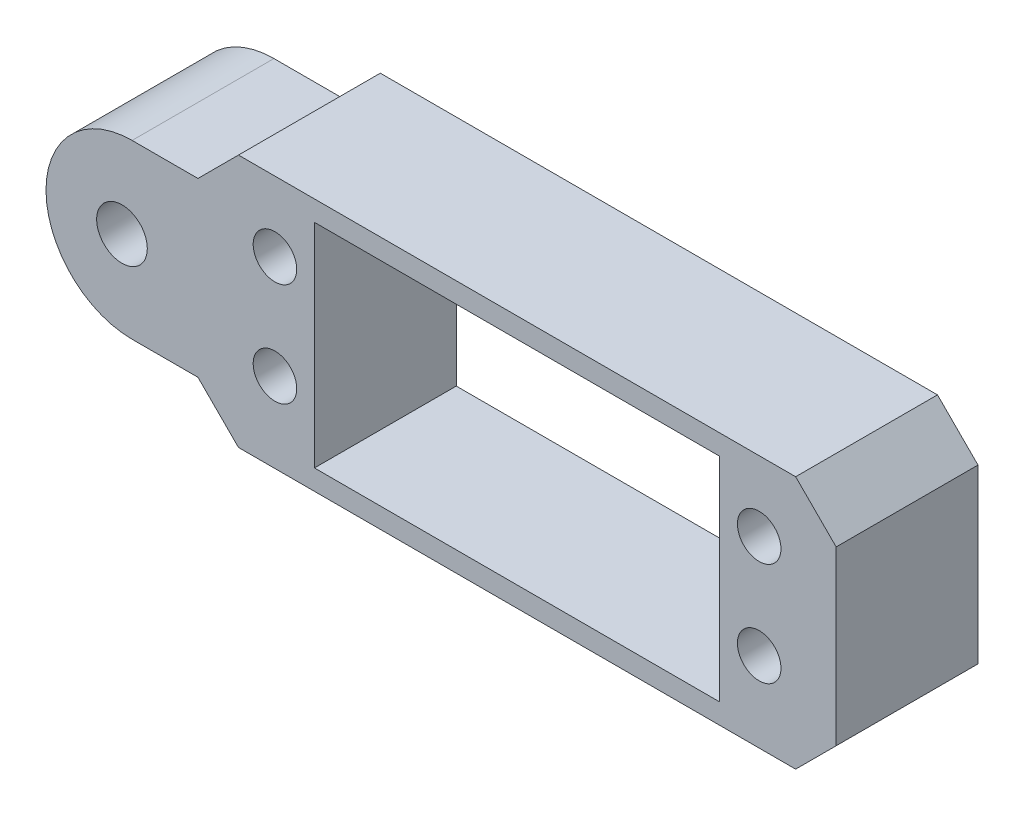
ISO-10303-21;
HEADER;
FILE_DESCRIPTION(('STEP AP214'),'2;1');
FILE_NAME('part.step','',(''),(''),'','','');
FILE_SCHEMA(('AUTOMOTIVE_DESIGN { 1 0 10303 214 1 1 1 1 }'));
ENDSEC;
DATA;
#1=APPLICATION_CONTEXT('core data for automotive mechanical design processes');
#2=APPLICATION_PROTOCOL_DEFINITION('international standard','automotive_design',2000,#1);
#3=PRODUCT_CONTEXT('',#1,'mechanical');
#4=PRODUCT('Part','Part','',(#3));
#5=PRODUCT_RELATED_PRODUCT_CATEGORY('part','',(#4));
#6=PRODUCT_DEFINITION_FORMATION('','',#4);
#7=PRODUCT_DEFINITION_CONTEXT('part definition',#1,'design');
#8=PRODUCT_DEFINITION('design','',#6,#7);
#9=PRODUCT_DEFINITION_SHAPE('','',#8);
#10=(LENGTH_UNIT() NAMED_UNIT(*) SI_UNIT(.MILLI.,.METRE.));
#11=(NAMED_UNIT(*) PLANE_ANGLE_UNIT() SI_UNIT($,.RADIAN.));
#12=(NAMED_UNIT(*) SI_UNIT($,.STERADIAN.) SOLID_ANGLE_UNIT());
#13=UNCERTAINTY_MEASURE_WITH_UNIT(LENGTH_MEASURE(1.E-05),#10,'distance_accuracy_value','');
#14=(GEOMETRIC_REPRESENTATION_CONTEXT(3) GLOBAL_UNCERTAINTY_ASSIGNED_CONTEXT((#13)) GLOBAL_UNIT_ASSIGNED_CONTEXT((#10,
#11,#12)) REPRESENTATION_CONTEXT('',''));
#15=CARTESIAN_POINT('',(0.,0.,0.));
#16=DIRECTION('',(0.,0.,1.));
#17=DIRECTION('',(1.,0.,0.));
#18=AXIS2_PLACEMENT_3D('',#15,#16,#17);
#19=CARTESIAN_POINT('',(-38.,0.,0.));
#20=DIRECTION('',(0.,0.,1.));
#21=DIRECTION('',(1.,0.,0.));
#22=AXIS2_PLACEMENT_3D('',#19,#20,#21);
#23=CYLINDRICAL_SURFACE('',#22,8.49999999999999);
#24=DIRECTION('',(0.,0.,1.));
#25=VECTOR('',#24,1.);
#26=CARTESIAN_POINT('',(-38.,8.5,-22.6715680975093));
#27=LINE('',#26,#25);
#28=CARTESIAN_POINT('',(-38.,8.5,0.));
#29=VERTEX_POINT('',#28);
#30=CARTESIAN_POINT('',(-38.,8.5,14.));
#31=VERTEX_POINT('',#30);
#32=EDGE_CURVE('E169',#29,#31,#27,.T.);
#33=ORIENTED_EDGE('',*,*,#32,.F.);
#34=CARTESIAN_POINT('',(-38.,0.,0.));
#35=DIRECTION('',(0.,0.,1.));
#36=DIRECTION('',(1.,0.,0.));
#37=AXIS2_PLACEMENT_3D('',#34,#35,#36);
#38=CIRCLE('',#37,8.49999999999999);
#39=CARTESIAN_POINT('',(-38.,-8.49999999999999,0.));
#40=VERTEX_POINT('',#39);
#41=EDGE_CURVE('E43',#40,#29,#38,.F.);
#42=ORIENTED_EDGE('',*,*,#41,.F.);
#43=DIRECTION('',(0.,0.,1.));
#44=VECTOR('',#43,1.);
#45=CARTESIAN_POINT('',(-38.,-8.49999999999999,-22.6715680975093));
#46=LINE('',#45,#44);
#47=CARTESIAN_POINT('',(-38.,-8.49999999999999,14.));
#48=VERTEX_POINT('',#47);
#49=EDGE_CURVE('E171',#48,#40,#46,.F.);
#50=ORIENTED_EDGE('',*,*,#49,.F.);
#51=CARTESIAN_POINT('',(-38.,0.,14.));
#52=DIRECTION('',(0.,0.,1.));
#53=DIRECTION('',(1.,0.,0.));
#54=AXIS2_PLACEMENT_3D('',#51,#52,#53);
#55=CIRCLE('',#54,8.49999999999999);
#56=EDGE_CURVE('E11',#31,#48,#55,.T.);
#57=ORIENTED_EDGE('',*,*,#56,.F.);
#58=EDGE_LOOP('',(#33,#42,#50,#57));
#59=FACE_BOUND('',#58,.T.);
#60=ADVANCED_FACE('F35',(#59),#23,.T.);
#61=CARTESIAN_POINT('',(0.,0.,14.));
#62=DIRECTION('',(0.,0.,1.));
#63=DIRECTION('',(1.,0.,0.));
#64=AXIS2_PLACEMENT_3D('',#61,#62,#63);
#65=PLANE('',#64);
#66=CARTESIAN_POINT('',(23.9,-4.60000000000001,14.));
#67=DIRECTION('',(0.,0.,-1.));
#68=DIRECTION('',(-1.,0.,0.));
#69=AXIS2_PLACEMENT_3D('',#66,#67,#68);
#70=CIRCLE('',#69,2.15);
#71=CARTESIAN_POINT('',(21.75,-4.60000000000001,14.));
#72=VERTEX_POINT('',#71);
#73=EDGE_CURVE('E196',#72,#72,#70,.T.);
#74=ORIENTED_EDGE('',*,*,#73,.T.);
#75=EDGE_LOOP('',(#74));
#76=FACE_BOUND('',#75,.T.);
#77=CARTESIAN_POINT('',(-23.8999999999999,5.59999999999998,14.));
#78=DIRECTION('',(0.,0.,-1.));
#79=DIRECTION('',(-1.,0.,0.));
#80=AXIS2_PLACEMENT_3D('',#77,#78,#79);
#81=CIRCLE('',#80,2.15);
#82=CARTESIAN_POINT('',(-26.0499999999999,5.59999999999998,14.));
#83=VERTEX_POINT('',#82);
#84=EDGE_CURVE('E203',#83,#83,#81,.T.);
#85=ORIENTED_EDGE('',*,*,#84,.T.);
#86=EDGE_LOOP('',(#85));
#87=FACE_BOUND('',#86,.T.);
#88=CARTESIAN_POINT('',(-23.8999999999999,-4.60000000000001,14.));
#89=DIRECTION('',(0.,0.,-1.));
#90=DIRECTION('',(-1.,0.,0.));
#91=AXIS2_PLACEMENT_3D('',#88,#89,#90);
#92=CIRCLE('',#91,2.15);
#93=CARTESIAN_POINT('',(-26.05,-4.60000000000001,14.));
#94=VERTEX_POINT('',#93);
#95=EDGE_CURVE('E190',#94,#94,#92,.T.);
#96=ORIENTED_EDGE('',*,*,#95,.T.);
#97=EDGE_LOOP('',(#96));
#98=FACE_BOUND('',#97,.T.);
#99=CARTESIAN_POINT('',(23.9,5.59999999999999,14.));
#100=DIRECTION('',(0.,0.,-1.));
#101=DIRECTION('',(-1.,0.,0.));
#102=AXIS2_PLACEMENT_3D('',#99,#100,#101);
#103=CIRCLE('',#102,2.15);
#104=CARTESIAN_POINT('',(21.75,5.59999999999999,14.));
#105=VERTEX_POINT('',#104);
#106=EDGE_CURVE('E208',#105,#105,#103,.T.);
#107=ORIENTED_EDGE('',*,*,#106,.T.);
#108=EDGE_LOOP('',(#107));
#109=FACE_BOUND('',#108,.T.);
#110=DIRECTION('',(-1.,0.,0.));
#111=VECTOR('',#110,1.);
#112=CARTESIAN_POINT('',(-31.5,8.5,14.));
#113=LINE('',#112,#111);
#114=CARTESIAN_POINT('',(-31.5,8.5,14.));
#115=VERTEX_POINT('',#114);
#116=EDGE_CURVE('E158',#115,#31,#113,.T.);
#117=ORIENTED_EDGE('',*,*,#116,.T.);
#118=ORIENTED_EDGE('',*,*,#56,.T.);
#119=DIRECTION('',(1.,0.,0.));
#120=VECTOR('',#119,1.);
#121=CARTESIAN_POINT('',(-31.5,-8.49999999999999,14.));
#122=LINE('',#121,#120);
#123=CARTESIAN_POINT('',(-31.5,-8.49999999999999,14.));
#124=VERTEX_POINT('',#123);
#125=EDGE_CURVE('E177',#48,#124,#122,.T.);
#126=ORIENTED_EDGE('',*,*,#125,.T.);
#127=DIRECTION('',(0.707106781186548,-0.707106781186547,0.));
#128=VECTOR('',#127,1.);
#129=CARTESIAN_POINT('',(-27.5,-12.5,14.));
#130=LINE('',#129,#128);
#131=CARTESIAN_POINT('',(-27.5,-12.5,14.));
#132=VERTEX_POINT('',#131);
#133=EDGE_CURVE('E253',#124,#132,#130,.T.);
#134=ORIENTED_EDGE('',*,*,#133,.T.);
#135=DIRECTION('',(1.,0.,0.));
#136=VECTOR('',#135,1.);
#137=CARTESIAN_POINT('',(-27.5,-12.5,14.));
#138=LINE('',#137,#136);
#139=CARTESIAN_POINT('',(27.5,-12.5,14.));
#140=VERTEX_POINT('',#139);
#141=EDGE_CURVE('E255',#132,#140,#138,.T.);
#142=ORIENTED_EDGE('',*,*,#141,.T.);
#143=DIRECTION('',(0.707106781186548,0.707106781186547,0.));
#144=VECTOR('',#143,1.);
#145=CARTESIAN_POINT('',(27.5,-12.5,14.));
#146=LINE('',#145,#144);
#147=CARTESIAN_POINT('',(31.5,-8.49999999999999,14.));
#148=VERTEX_POINT('',#147);
#149=EDGE_CURVE('E257',#140,#148,#146,.T.);
#150=ORIENTED_EDGE('',*,*,#149,.T.);
#151=DIRECTION('',(0.,1.,0.));
#152=VECTOR('',#151,1.);
#153=CARTESIAN_POINT('',(31.5,8.5,14.));
#154=LINE('',#153,#152);
#155=CARTESIAN_POINT('',(31.5,8.5,14.));
#156=VERTEX_POINT('',#155);
#157=EDGE_CURVE('E259',#148,#156,#154,.T.);
#158=ORIENTED_EDGE('',*,*,#157,.T.);
#159=DIRECTION('',(-0.707106781186548,0.707106781186547,0.));
#160=VECTOR('',#159,1.);
#161=CARTESIAN_POINT('',(27.5,12.5,14.));
#162=LINE('',#161,#160);
#163=CARTESIAN_POINT('',(27.5,12.5,14.));
#164=VERTEX_POINT('',#163);
#165=EDGE_CURVE('E245',#156,#164,#162,.T.);
#166=ORIENTED_EDGE('',*,*,#165,.T.);
#167=DIRECTION('',(-1.,0.,0.));
#168=VECTOR('',#167,1.);
#169=CARTESIAN_POINT('',(-27.5,12.5,14.));
#170=LINE('',#169,#168);
#171=CARTESIAN_POINT('',(-27.5,12.5,14.));
#172=VERTEX_POINT('',#171);
#173=EDGE_CURVE('E248',#164,#172,#170,.T.);
#174=ORIENTED_EDGE('',*,*,#173,.T.);
#175=DIRECTION('',(-0.707106781186548,-0.707106781186547,0.));
#176=VECTOR('',#175,1.);
#177=CARTESIAN_POINT('',(-27.5,12.5,14.));
#178=LINE('',#177,#176);
#179=EDGE_CURVE('E251',#172,#115,#178,.T.);
#180=ORIENTED_EDGE('',*,*,#179,.T.);
#181=EDGE_LOOP('',(#117,#118,#126,#134,#142,#150,#158,#166,#174,#180));
#182=FACE_BOUND('',#181,.T.);
#183=DIRECTION('',(-1.,0.,0.));
#184=VECTOR('',#183,1.);
#185=CARTESIAN_POINT('',(-20.,10.5,14.));
#186=LINE('',#185,#184);
#187=CARTESIAN_POINT('',(20.,10.5,14.));
#188=VERTEX_POINT('',#187);
#189=CARTESIAN_POINT('',(-20.,10.5,14.));
#190=VERTEX_POINT('',#189);
#191=EDGE_CURVE('E216',#188,#190,#186,.T.);
#192=ORIENTED_EDGE('',*,*,#191,.F.);
#193=DIRECTION('',(0.,1.,0.));
#194=VECTOR('',#193,1.);
#195=CARTESIAN_POINT('',(20.,10.5,14.));
#196=LINE('',#195,#194);
#197=CARTESIAN_POINT('',(20.,-10.5,14.));
#198=VERTEX_POINT('',#197);
#199=EDGE_CURVE('E214',#198,#188,#196,.T.);
#200=ORIENTED_EDGE('',*,*,#199,.F.);
#201=DIRECTION('',(1.,0.,0.));
#202=VECTOR('',#201,1.);
#203=CARTESIAN_POINT('',(-20.,-10.5,14.));
#204=LINE('',#203,#202);
#205=CARTESIAN_POINT('',(-20.,-10.5,14.));
#206=VERTEX_POINT('',#205);
#207=EDGE_CURVE('E222',#206,#198,#204,.T.);
#208=ORIENTED_EDGE('',*,*,#207,.F.);
#209=DIRECTION('',(0.,-1.,0.));
#210=VECTOR('',#209,1.);
#211=CARTESIAN_POINT('',(-20.,10.5,14.));
#212=LINE('',#211,#210);
#213=EDGE_CURVE('E219',#190,#206,#212,.T.);
#214=ORIENTED_EDGE('',*,*,#213,.F.);
#215=EDGE_LOOP('',(#192,#200,#208,#214));
#216=FACE_BOUND('',#215,.T.);
#217=CARTESIAN_POINT('',(-39.,0.,14.));
#218=DIRECTION('',(0.,0.,1.));
#219=DIRECTION('',(1.,0.,0.));
#220=AXIS2_PLACEMENT_3D('',#217,#218,#219);
#221=CIRCLE('',#220,2.5);
#222=CARTESIAN_POINT('',(-36.5,0.,14.));
#223=VERTEX_POINT('',#222);
#224=EDGE_CURVE('E183',#223,#223,#221,.T.);
#225=ORIENTED_EDGE('',*,*,#224,.F.);
#226=EDGE_LOOP('',(#225));
#227=FACE_BOUND('',#226,.T.);
#228=ADVANCED_FACE('F298',(#76,#87,#98,#109,#182,#216,#227),#65,.T.);
#229=CARTESIAN_POINT('',(0.,0.,0.));
#230=DIRECTION('',(0.,0.,1.));
#231=DIRECTION('',(1.,0.,0.));
#232=AXIS2_PLACEMENT_3D('',#229,#230,#231);
#233=PLANE('',#232);
#234=CARTESIAN_POINT('',(23.9,-4.60000000000001,0.));
#235=DIRECTION('',(0.,0.,-1.));
#236=DIRECTION('',(-1.,0.,0.));
#237=AXIS2_PLACEMENT_3D('',#234,#235,#236);
#238=CIRCLE('',#237,2.15);
#239=CARTESIAN_POINT('',(21.75,-4.60000000000001,0.));
#240=VERTEX_POINT('',#239);
#241=EDGE_CURVE('E200',#240,#240,#238,.T.);
#242=ORIENTED_EDGE('',*,*,#241,.F.);
#243=EDGE_LOOP('',(#242));
#244=FACE_BOUND('',#243,.T.);
#245=CARTESIAN_POINT('',(-23.8999999999999,5.59999999999998,0.));
#246=DIRECTION('',(0.,0.,-1.));
#247=DIRECTION('',(-1.,0.,0.));
#248=AXIS2_PLACEMENT_3D('',#245,#246,#247);
#249=CIRCLE('',#248,2.15);
#250=CARTESIAN_POINT('',(-26.0499999999999,5.59999999999998,0.));
#251=VERTEX_POINT('',#250);
#252=EDGE_CURVE('E193',#251,#251,#249,.T.);
#253=ORIENTED_EDGE('',*,*,#252,.F.);
#254=EDGE_LOOP('',(#253));
#255=FACE_BOUND('',#254,.T.);
#256=CARTESIAN_POINT('',(-23.8999999999999,-4.60000000000001,0.));
#257=DIRECTION('',(0.,0.,-1.));
#258=DIRECTION('',(-1.,0.,0.));
#259=AXIS2_PLACEMENT_3D('',#256,#257,#258);
#260=CIRCLE('',#259,2.15);
#261=CARTESIAN_POINT('',(-26.05,-4.60000000000001,0.));
#262=VERTEX_POINT('',#261);
#263=EDGE_CURVE('E189',#262,#262,#260,.T.);
#264=ORIENTED_EDGE('',*,*,#263,.F.);
#265=EDGE_LOOP('',(#264));
#266=FACE_BOUND('',#265,.T.);
#267=CARTESIAN_POINT('',(23.9,5.59999999999999,0.));
#268=DIRECTION('',(0.,0.,-1.));
#269=DIRECTION('',(-1.,0.,0.));
#270=AXIS2_PLACEMENT_3D('',#267,#268,#269);
#271=CIRCLE('',#270,2.15);
#272=CARTESIAN_POINT('',(21.75,5.59999999999999,0.));
#273=VERTEX_POINT('',#272);
#274=EDGE_CURVE('E199',#273,#273,#271,.T.);
#275=ORIENTED_EDGE('',*,*,#274,.F.);
#276=EDGE_LOOP('',(#275));
#277=FACE_BOUND('',#276,.T.);
#278=DIRECTION('',(-1.,0.,0.));
#279=VECTOR('',#278,1.);
#280=CARTESIAN_POINT('',(-31.5,-8.49999999999999,0.));
#281=LINE('',#280,#279);
#282=CARTESIAN_POINT('',(-31.5,-8.49999999999999,0.));
#283=VERTEX_POINT('',#282);
#284=EDGE_CURVE('E143',#283,#40,#281,.T.);
#285=ORIENTED_EDGE('',*,*,#284,.T.);
#286=ORIENTED_EDGE('',*,*,#41,.T.);
#287=DIRECTION('',(1.,0.,0.));
#288=VECTOR('',#287,1.);
#289=CARTESIAN_POINT('',(-31.5,8.5,0.));
#290=LINE('',#289,#288);
#291=CARTESIAN_POINT('',(-31.5,8.5,0.));
#292=VERTEX_POINT('',#291);
#293=EDGE_CURVE('E133',#29,#292,#290,.T.);
#294=ORIENTED_EDGE('',*,*,#293,.T.);
#295=DIRECTION('',(-0.707106781186548,-0.707106781186547,0.));
#296=VECTOR('',#295,1.);
#297=CARTESIAN_POINT('',(-27.5,12.5,0.));
#298=LINE('',#297,#296);
#299=CARTESIAN_POINT('',(-27.5,12.5,0.));
#300=VERTEX_POINT('',#299);
#301=EDGE_CURVE('E138',#300,#292,#298,.T.);
#302=ORIENTED_EDGE('',*,*,#301,.F.);
#303=DIRECTION('',(-1.,0.,0.));
#304=VECTOR('',#303,1.);
#305=CARTESIAN_POINT('',(-27.5,12.5,0.));
#306=LINE('',#305,#304);
#307=CARTESIAN_POINT('',(27.5,12.5,0.));
#308=VERTEX_POINT('',#307);
#309=EDGE_CURVE('E155',#308,#300,#306,.T.);
#310=ORIENTED_EDGE('',*,*,#309,.F.);
#311=DIRECTION('',(-0.707106781186548,0.707106781186547,0.));
#312=VECTOR('',#311,1.);
#313=CARTESIAN_POINT('',(27.5,12.5,0.));
#314=LINE('',#313,#312);
#315=CARTESIAN_POINT('',(31.5,8.5,0.));
#316=VERTEX_POINT('',#315);
#317=EDGE_CURVE('E244',#316,#308,#314,.T.);
#318=ORIENTED_EDGE('',*,*,#317,.F.);
#319=DIRECTION('',(0.,1.,0.));
#320=VECTOR('',#319,1.);
#321=CARTESIAN_POINT('',(31.5,8.5,0.));
#322=LINE('',#321,#320);
#323=CARTESIAN_POINT('',(31.5,-8.49999999999999,0.));
#324=VERTEX_POINT('',#323);
#325=EDGE_CURVE('E249',#324,#316,#322,.T.);
#326=ORIENTED_EDGE('',*,*,#325,.F.);
#327=DIRECTION('',(0.707106781186548,0.707106781186547,0.));
#328=VECTOR('',#327,1.);
#329=CARTESIAN_POINT('',(27.5,-12.5,0.));
#330=LINE('',#329,#328);
#331=CARTESIAN_POINT('',(27.5,-12.5,0.));
#332=VERTEX_POINT('',#331);
#333=EDGE_CURVE('E268',#332,#324,#330,.T.);
#334=ORIENTED_EDGE('',*,*,#333,.F.);
#335=DIRECTION('',(1.,0.,0.));
#336=VECTOR('',#335,1.);
#337=CARTESIAN_POINT('',(-27.5,-12.5,0.));
#338=LINE('',#337,#336);
#339=CARTESIAN_POINT('',(-27.5,-12.5,0.));
#340=VERTEX_POINT('',#339);
#341=EDGE_CURVE('E266',#340,#332,#338,.T.);
#342=ORIENTED_EDGE('',*,*,#341,.F.);
#343=DIRECTION('',(0.707106781186548,-0.707106781186547,0.));
#344=VECTOR('',#343,1.);
#345=CARTESIAN_POINT('',(-27.5,-12.5,0.));
#346=LINE('',#345,#344);
#347=EDGE_CURVE('E154',#283,#340,#346,.T.);
#348=ORIENTED_EDGE('',*,*,#347,.F.);
#349=EDGE_LOOP('',(#285,#286,#294,#302,#310,#318,#326,#334,#342,#348));
#350=FACE_BOUND('',#349,.T.);
#351=DIRECTION('',(0.,1.,0.));
#352=VECTOR('',#351,1.);
#353=CARTESIAN_POINT('',(20.,10.5,0.));
#354=LINE('',#353,#352);
#355=CARTESIAN_POINT('',(20.,-10.5,0.));
#356=VERTEX_POINT('',#355);
#357=CARTESIAN_POINT('',(20.,10.5,0.));
#358=VERTEX_POINT('',#357);
#359=EDGE_CURVE('E211',#356,#358,#354,.T.);
#360=ORIENTED_EDGE('',*,*,#359,.T.);
#361=DIRECTION('',(-1.,0.,0.));
#362=VECTOR('',#361,1.);
#363=CARTESIAN_POINT('',(-20.,10.5,0.));
#364=LINE('',#363,#362);
#365=CARTESIAN_POINT('',(-20.,10.5,0.));
#366=VERTEX_POINT('',#365);
#367=EDGE_CURVE('E227',#358,#366,#364,.T.);
#368=ORIENTED_EDGE('',*,*,#367,.T.);
#369=DIRECTION('',(0.,-1.,0.));
#370=VECTOR('',#369,1.);
#371=CARTESIAN_POINT('',(-20.,10.5,0.));
#372=LINE('',#371,#370);
#373=CARTESIAN_POINT('',(-20.,-10.5,0.));
#374=VERTEX_POINT('',#373);
#375=EDGE_CURVE('E230',#366,#374,#372,.T.);
#376=ORIENTED_EDGE('',*,*,#375,.T.);
#377=DIRECTION('',(1.,0.,0.));
#378=VECTOR('',#377,1.);
#379=CARTESIAN_POINT('',(-20.,-10.5,0.));
#380=LINE('',#379,#378);
#381=EDGE_CURVE('E217',#374,#356,#380,.T.);
#382=ORIENTED_EDGE('',*,*,#381,.T.);
#383=EDGE_LOOP('',(#360,#368,#376,#382));
#384=FACE_BOUND('',#383,.T.);
#385=CARTESIAN_POINT('',(-39.,0.,0.));
#386=DIRECTION('',(0.,0.,1.));
#387=DIRECTION('',(1.,0.,0.));
#388=AXIS2_PLACEMENT_3D('',#385,#386,#387);
#389=CIRCLE('',#388,2.5);
#390=CARTESIAN_POINT('',(-36.5,0.,0.));
#391=VERTEX_POINT('',#390);
#392=EDGE_CURVE('E142',#391,#391,#389,.F.);
#393=ORIENTED_EDGE('',*,*,#392,.F.);
#394=EDGE_LOOP('',(#393));
#395=FACE_BOUND('',#394,.T.);
#396=ADVANCED_FACE('F136',(#244,#255,#266,#277,#350,#384,#395),#233,.F.);
#397=CARTESIAN_POINT('',(27.5,12.5,14.));
#398=DIRECTION('',(-0.707106781186547,-0.707106781186548,0.));
#399=DIRECTION('',(0.707106781186548,-0.707106781186547,0.));
#400=AXIS2_PLACEMENT_3D('',#397,#398,#399);
#401=PLANE('',#400);
#402=ORIENTED_EDGE('',*,*,#317,.T.);
#403=DIRECTION('',(0.,0.,-1.));
#404=VECTOR('',#403,1.);
#405=CARTESIAN_POINT('',(27.5,12.5,14.));
#406=LINE('',#405,#404);
#407=EDGE_CURVE('E161',#164,#308,#406,.T.);
#408=ORIENTED_EDGE('',*,*,#407,.F.);
#409=ORIENTED_EDGE('',*,*,#165,.F.);
#410=DIRECTION('',(0.,0.,-1.));
#411=VECTOR('',#410,1.);
#412=CARTESIAN_POINT('',(31.5,8.5,14.));
#413=LINE('',#412,#411);
#414=EDGE_CURVE('E261',#156,#316,#413,.T.);
#415=ORIENTED_EDGE('',*,*,#414,.T.);
#416=EDGE_LOOP('',(#402,#408,#409,#415));
#417=FACE_BOUND('',#416,.T.);
#418=ADVANCED_FACE('F319',(#417),#401,.F.);
#419=CARTESIAN_POINT('',(-27.5,12.5,14.));
#420=DIRECTION('',(0.,-1.,0.));
#421=DIRECTION('',(0.,0.,-1.));
#422=AXIS2_PLACEMENT_3D('',#419,#420,#421);
#423=PLANE('',#422);
#424=ORIENTED_EDGE('',*,*,#309,.T.);
#425=DIRECTION('',(0.,0.,-1.));
#426=VECTOR('',#425,1.);
#427=CARTESIAN_POINT('',(-27.5,12.5,14.));
#428=LINE('',#427,#426);
#429=EDGE_CURVE('E153',#172,#300,#428,.T.);
#430=ORIENTED_EDGE('',*,*,#429,.F.);
#431=ORIENTED_EDGE('',*,*,#173,.F.);
#432=ORIENTED_EDGE('',*,*,#407,.T.);
#433=EDGE_LOOP('',(#424,#430,#431,#432));
#434=FACE_BOUND('',#433,.T.);
#435=ADVANCED_FACE('F309',(#434),#423,.F.);
#436=CARTESIAN_POINT('',(-27.5,12.5,14.));
#437=DIRECTION('',(0.707106781186547,-0.707106781186548,0.));
#438=DIRECTION('',(0.707106781186548,0.707106781186547,0.));
#439=AXIS2_PLACEMENT_3D('',#436,#437,#438);
#440=PLANE('',#439);
#441=ORIENTED_EDGE('',*,*,#301,.T.);
#442=DIRECTION('',(0.,0.,-1.));
#443=VECTOR('',#442,1.);
#444=CARTESIAN_POINT('',(-31.5,8.5,14.));
#445=LINE('',#444,#443);
#446=EDGE_CURVE('E150',#115,#292,#445,.T.);
#447=ORIENTED_EDGE('',*,*,#446,.F.);
#448=ORIENTED_EDGE('',*,*,#179,.F.);
#449=ORIENTED_EDGE('',*,*,#429,.T.);
#450=EDGE_LOOP('',(#441,#447,#448,#449));
#451=FACE_BOUND('',#450,.T.);
#452=ADVANCED_FACE('F148',(#451),#440,.F.);
#453=CARTESIAN_POINT('',(-27.5,-12.5,14.));
#454=DIRECTION('',(0.707106781186547,0.707106781186548,0.));
#455=DIRECTION('',(-0.707106781186548,0.707106781186547,0.));
#456=AXIS2_PLACEMENT_3D('',#453,#454,#455);
#457=PLANE('',#456);
#458=ORIENTED_EDGE('',*,*,#347,.T.);
#459=DIRECTION('',(0.,0.,-1.));
#460=VECTOR('',#459,1.);
#461=CARTESIAN_POINT('',(-27.5,-12.5,14.));
#462=LINE('',#461,#460);
#463=EDGE_CURVE('E163',#132,#340,#462,.T.);
#464=ORIENTED_EDGE('',*,*,#463,.F.);
#465=ORIENTED_EDGE('',*,*,#133,.F.);
#466=DIRECTION('',(0.,0.,-1.));
#467=VECTOR('',#466,1.);
#468=CARTESIAN_POINT('',(-31.5,-8.49999999999999,14.));
#469=LINE('',#468,#467);
#470=EDGE_CURVE('E159',#124,#283,#469,.T.);
#471=ORIENTED_EDGE('',*,*,#470,.T.);
#472=EDGE_LOOP('',(#458,#464,#465,#471));
#473=FACE_BOUND('',#472,.T.);
#474=ADVANCED_FACE('F301',(#473),#457,.F.);
#475=CARTESIAN_POINT('',(-27.5,-12.5,14.));
#476=DIRECTION('',(0.,1.,0.));
#477=DIRECTION('',(0.,0.,1.));
#478=AXIS2_PLACEMENT_3D('',#475,#476,#477);
#479=PLANE('',#478);
#480=ORIENTED_EDGE('',*,*,#341,.T.);
#481=DIRECTION('',(0.,0.,-1.));
#482=VECTOR('',#481,1.);
#483=CARTESIAN_POINT('',(27.5,-12.5,14.));
#484=LINE('',#483,#482);
#485=EDGE_CURVE('E276',#140,#332,#484,.T.);
#486=ORIENTED_EDGE('',*,*,#485,.F.);
#487=ORIENTED_EDGE('',*,*,#141,.F.);
#488=ORIENTED_EDGE('',*,*,#463,.T.);
#489=EDGE_LOOP('',(#480,#486,#487,#488));
#490=FACE_BOUND('',#489,.T.);
#491=ADVANCED_FACE('F282',(#490),#479,.F.);
#492=CARTESIAN_POINT('',(27.5,-12.5,14.));
#493=DIRECTION('',(-0.707106781186547,0.707106781186548,0.));
#494=DIRECTION('',(-0.707106781186548,-0.707106781186547,0.));
#495=AXIS2_PLACEMENT_3D('',#492,#493,#494);
#496=PLANE('',#495);
#497=ORIENTED_EDGE('',*,*,#333,.T.);
#498=DIRECTION('',(0.,0.,-1.));
#499=VECTOR('',#498,1.);
#500=CARTESIAN_POINT('',(31.5,-8.49999999999999,14.));
#501=LINE('',#500,#499);
#502=EDGE_CURVE('E273',#148,#324,#501,.T.);
#503=ORIENTED_EDGE('',*,*,#502,.F.);
#504=ORIENTED_EDGE('',*,*,#149,.F.);
#505=ORIENTED_EDGE('',*,*,#485,.T.);
#506=EDGE_LOOP('',(#497,#503,#504,#505));
#507=FACE_BOUND('',#506,.T.);
#508=ADVANCED_FACE('F291',(#507),#496,.F.);
#509=CARTESIAN_POINT('',(31.5,8.5,14.));
#510=DIRECTION('',(-1.,0.,0.));
#511=DIRECTION('',(0.,0.,1.));
#512=AXIS2_PLACEMENT_3D('',#509,#510,#511);
#513=PLANE('',#512);
#514=ORIENTED_EDGE('',*,*,#325,.T.);
#515=ORIENTED_EDGE('',*,*,#414,.F.);
#516=ORIENTED_EDGE('',*,*,#157,.F.);
#517=ORIENTED_EDGE('',*,*,#502,.T.);
#518=EDGE_LOOP('',(#514,#515,#516,#517));
#519=FACE_BOUND('',#518,.T.);
#520=ADVANCED_FACE('F295',(#519),#513,.F.);
#521=CARTESIAN_POINT('',(20.,10.5,14.));
#522=DIRECTION('',(-1.,0.,0.));
#523=DIRECTION('',(0.,0.,1.));
#524=AXIS2_PLACEMENT_3D('',#521,#522,#523);
#525=PLANE('',#524);
#526=ORIENTED_EDGE('',*,*,#359,.F.);
#527=DIRECTION('',(0.,0.,-1.));
#528=VECTOR('',#527,1.);
#529=CARTESIAN_POINT('',(20.,-10.5,14.));
#530=LINE('',#529,#528);
#531=EDGE_CURVE('E224',#198,#356,#530,.T.);
#532=ORIENTED_EDGE('',*,*,#531,.F.);
#533=ORIENTED_EDGE('',*,*,#199,.T.);
#534=DIRECTION('',(0.,0.,-1.));
#535=VECTOR('',#534,1.);
#536=CARTESIAN_POINT('',(20.,10.5,14.));
#537=LINE('',#536,#535);
#538=EDGE_CURVE('E241',#188,#358,#537,.T.);
#539=ORIENTED_EDGE('',*,*,#538,.T.);
#540=EDGE_LOOP('',(#526,#532,#533,#539));
#541=FACE_BOUND('',#540,.T.);
#542=ADVANCED_FACE('F336',(#541),#525,.T.);
#543=CARTESIAN_POINT('',(-20.,10.5,14.));
#544=DIRECTION('',(0.,-1.,0.));
#545=DIRECTION('',(0.,0.,-1.));
#546=AXIS2_PLACEMENT_3D('',#543,#544,#545);
#547=PLANE('',#546);
#548=ORIENTED_EDGE('',*,*,#367,.F.);
#549=ORIENTED_EDGE('',*,*,#538,.F.);
#550=ORIENTED_EDGE('',*,*,#191,.T.);
#551=DIRECTION('',(0.,0.,-1.));
#552=VECTOR('',#551,1.);
#553=CARTESIAN_POINT('',(-20.,10.5,14.));
#554=LINE('',#553,#552);
#555=EDGE_CURVE('E239',#190,#366,#554,.T.);
#556=ORIENTED_EDGE('',*,*,#555,.T.);
#557=EDGE_LOOP('',(#548,#549,#550,#556));
#558=FACE_BOUND('',#557,.T.);
#559=ADVANCED_FACE('F352',(#558),#547,.T.);
#560=CARTESIAN_POINT('',(-20.,10.5,14.));
#561=DIRECTION('',(1.,0.,0.));
#562=DIRECTION('',(0.,1.,0.));
#563=AXIS2_PLACEMENT_3D('',#560,#561,#562);
#564=PLANE('',#563);
#565=ORIENTED_EDGE('',*,*,#375,.F.);
#566=ORIENTED_EDGE('',*,*,#555,.F.);
#567=ORIENTED_EDGE('',*,*,#213,.T.);
#568=DIRECTION('',(0.,0.,-1.));
#569=VECTOR('',#568,1.);
#570=CARTESIAN_POINT('',(-20.,-10.5,14.));
#571=LINE('',#570,#569);
#572=EDGE_CURVE('E237',#206,#374,#571,.T.);
#573=ORIENTED_EDGE('',*,*,#572,.T.);
#574=EDGE_LOOP('',(#565,#566,#567,#573));
#575=FACE_BOUND('',#574,.T.);
#576=ADVANCED_FACE('F359',(#575),#564,.T.);
#577=CARTESIAN_POINT('',(-20.,-10.5,14.));
#578=DIRECTION('',(0.,1.,0.));
#579=DIRECTION('',(0.,0.,1.));
#580=AXIS2_PLACEMENT_3D('',#577,#578,#579);
#581=PLANE('',#580);
#582=ORIENTED_EDGE('',*,*,#381,.F.);
#583=ORIENTED_EDGE('',*,*,#572,.F.);
#584=ORIENTED_EDGE('',*,*,#207,.T.);
#585=ORIENTED_EDGE('',*,*,#531,.T.);
#586=EDGE_LOOP('',(#582,#583,#584,#585));
#587=FACE_BOUND('',#586,.T.);
#588=ADVANCED_FACE('F367',(#587),#581,.T.);
#589=CARTESIAN_POINT('',(23.9,5.59999999999999,14.));
#590=DIRECTION('',(0.,0.,-1.));
#591=DIRECTION('',(-1.,0.,0.));
#592=AXIS2_PLACEMENT_3D('',#589,#590,#591);
#593=CYLINDRICAL_SURFACE('',#592,2.15);
#594=ORIENTED_EDGE('',*,*,#106,.F.);
#595=EDGE_LOOP('',(#594));
#596=FACE_BOUND('',#595,.T.);
#597=ORIENTED_EDGE('',*,*,#274,.T.);
#598=EDGE_LOOP('',(#597));
#599=FACE_BOUND('',#598,.T.);
#600=ADVANCED_FACE('F375',(#596,#599),#593,.F.);
#601=CARTESIAN_POINT('',(-23.8999999999999,-4.60000000000001,14.));
#602=DIRECTION('',(0.,0.,-1.));
#603=DIRECTION('',(-1.,0.,0.));
#604=AXIS2_PLACEMENT_3D('',#601,#602,#603);
#605=CYLINDRICAL_SURFACE('',#604,2.15);
#606=ORIENTED_EDGE('',*,*,#95,.F.);
#607=EDGE_LOOP('',(#606));
#608=FACE_BOUND('',#607,.T.);
#609=ORIENTED_EDGE('',*,*,#263,.T.);
#610=EDGE_LOOP('',(#609));
#611=FACE_BOUND('',#610,.T.);
#612=ADVANCED_FACE('F383',(#608,#611),#605,.F.);
#613=CARTESIAN_POINT('',(-23.8999999999999,5.59999999999998,14.));
#614=DIRECTION('',(0.,0.,-1.));
#615=DIRECTION('',(-1.,0.,0.));
#616=AXIS2_PLACEMENT_3D('',#613,#614,#615);
#617=CYLINDRICAL_SURFACE('',#616,2.15);
#618=ORIENTED_EDGE('',*,*,#84,.F.);
#619=EDGE_LOOP('',(#618));
#620=FACE_BOUND('',#619,.T.);
#621=ORIENTED_EDGE('',*,*,#252,.T.);
#622=EDGE_LOOP('',(#621));
#623=FACE_BOUND('',#622,.T.);
#624=ADVANCED_FACE('F391',(#620,#623),#617,.F.);
#625=CARTESIAN_POINT('',(23.9,-4.60000000000001,14.));
#626=DIRECTION('',(0.,0.,-1.));
#627=DIRECTION('',(-1.,0.,0.));
#628=AXIS2_PLACEMENT_3D('',#625,#626,#627);
#629=CYLINDRICAL_SURFACE('',#628,2.15);
#630=ORIENTED_EDGE('',*,*,#73,.F.);
#631=EDGE_LOOP('',(#630));
#632=FACE_BOUND('',#631,.T.);
#633=ORIENTED_EDGE('',*,*,#241,.T.);
#634=EDGE_LOOP('',(#633));
#635=FACE_BOUND('',#634,.T.);
#636=ADVANCED_FACE('F399',(#632,#635),#629,.F.);
#637=CARTESIAN_POINT('',(-31.5,8.5,-22.6715680975093));
#638=DIRECTION('',(0.,1.,0.));
#639=DIRECTION('',(-1.,0.,0.));
#640=AXIS2_PLACEMENT_3D('',#637,#638,#639);
#641=PLANE('',#640);
#642=ORIENTED_EDGE('',*,*,#293,.F.);
#643=ORIENTED_EDGE('',*,*,#32,.T.);
#644=ORIENTED_EDGE('',*,*,#116,.F.);
#645=ORIENTED_EDGE('',*,*,#446,.T.);
#646=EDGE_LOOP('',(#642,#643,#644,#645));
#647=FACE_BOUND('',#646,.T.);
#648=ADVANCED_FACE('F157',(#647),#641,.T.);
#649=CARTESIAN_POINT('',(-31.5,-8.49999999999999,-22.6715680975093));
#650=DIRECTION('',(0.,-1.,0.));
#651=DIRECTION('',(1.,0.,0.));
#652=AXIS2_PLACEMENT_3D('',#649,#650,#651);
#653=PLANE('',#652);
#654=ORIENTED_EDGE('',*,*,#125,.F.);
#655=ORIENTED_EDGE('',*,*,#49,.T.);
#656=ORIENTED_EDGE('',*,*,#284,.F.);
#657=ORIENTED_EDGE('',*,*,#470,.F.);
#658=EDGE_LOOP('',(#654,#655,#656,#657));
#659=FACE_BOUND('',#658,.T.);
#660=ADVANCED_FACE('F175',(#659),#653,.T.);
#661=CARTESIAN_POINT('',(-39.,0.,-22.6715680975093));
#662=DIRECTION('',(0.,0.,1.));
#663=DIRECTION('',(1.,0.,0.));
#664=AXIS2_PLACEMENT_3D('',#661,#662,#663);
#665=CYLINDRICAL_SURFACE('',#664,2.5);
#666=ORIENTED_EDGE('',*,*,#392,.T.);
#667=EDGE_LOOP('',(#666));
#668=FACE_BOUND('',#667,.T.);
#669=ORIENTED_EDGE('',*,*,#224,.T.);
#670=EDGE_LOOP('',(#669));
#671=FACE_BOUND('',#670,.T.);
#672=ADVANCED_FACE('F421',(#668,#671),#665,.F.);
#673=CLOSED_SHELL('',(#60,#228,#396,#418,#435,#452,#474,#491,#508,#520,#542,#559,#576,#588,#600,
#612,#624,#636,#648,#660,#672));
#674=MANIFOLD_SOLID_BREP('B2',#673);
#675=ADVANCED_BREP_SHAPE_REPRESENTATION('',(#18,#674),#14);
#676=SHAPE_DEFINITION_REPRESENTATION(#9,#675);
ENDSEC;
END-ISO-10303-21;
